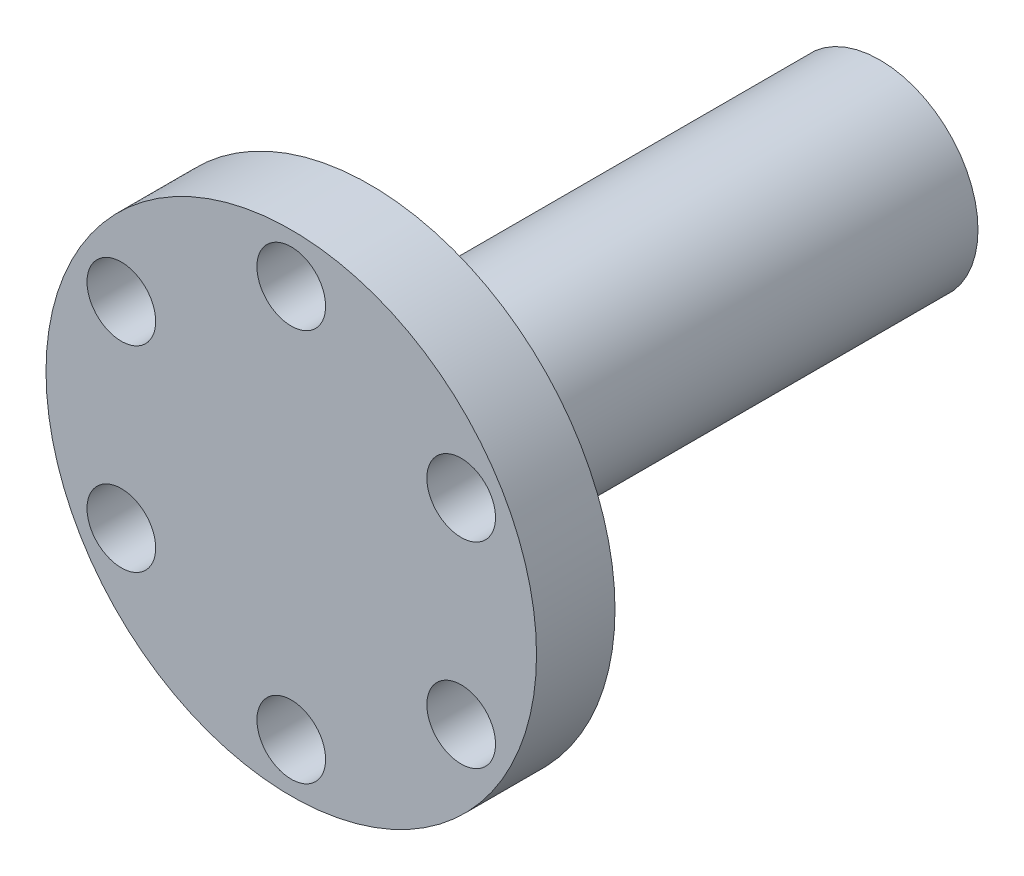
ISO-10303-21;
HEADER;
FILE_DESCRIPTION(('STEP AP214'),'2;1');
FILE_NAME('part.step','',(''),(''),'','','');
FILE_SCHEMA(('AUTOMOTIVE_DESIGN { 1 0 10303 214 1 1 1 1 }'));
ENDSEC;
DATA;
#1=APPLICATION_CONTEXT('core data for automotive mechanical design processes');
#2=APPLICATION_PROTOCOL_DEFINITION('international standard','automotive_design',2000,#1);
#3=PRODUCT_CONTEXT('',#1,'mechanical');
#4=PRODUCT('Part','Part','',(#3));
#5=PRODUCT_RELATED_PRODUCT_CATEGORY('part','',(#4));
#6=PRODUCT_DEFINITION_FORMATION('','',#4);
#7=PRODUCT_DEFINITION_CONTEXT('part definition',#1,'design');
#8=PRODUCT_DEFINITION('design','',#6,#7);
#9=PRODUCT_DEFINITION_SHAPE('','',#8);
#10=(LENGTH_UNIT() NAMED_UNIT(*) SI_UNIT(.MILLI.,.METRE.));
#11=(NAMED_UNIT(*) PLANE_ANGLE_UNIT() SI_UNIT($,.RADIAN.));
#12=(NAMED_UNIT(*) SI_UNIT($,.STERADIAN.) SOLID_ANGLE_UNIT());
#13=UNCERTAINTY_MEASURE_WITH_UNIT(LENGTH_MEASURE(1.E-05),#10,'distance_accuracy_value','');
#14=(GEOMETRIC_REPRESENTATION_CONTEXT(3) GLOBAL_UNCERTAINTY_ASSIGNED_CONTEXT((#13)) GLOBAL_UNIT_ASSIGNED_CONTEXT((#10,
#11,#12)) REPRESENTATION_CONTEXT('',''));
#15=CARTESIAN_POINT('',(0.,0.,0.));
#16=DIRECTION('',(0.,0.,1.));
#17=DIRECTION('',(1.,0.,0.));
#18=AXIS2_PLACEMENT_3D('',#15,#16,#17);
#19=CARTESIAN_POINT('',(5.00000000000001,0.,-4.));
#20=DIRECTION('',(0.,0.,1.));
#21=DIRECTION('',(1.,0.,0.));
#22=AXIS2_PLACEMENT_3D('',#19,#20,#21);
#23=PLANE('',#22);
#24=CARTESIAN_POINT('',(0.,10.,-4.));
#25=DIRECTION('',(0.,0.,-1.));
#26=DIRECTION('',(-1.,0.,0.));
#27=AXIS2_PLACEMENT_3D('',#24,#25,#26);
#28=CIRCLE('',#27,1.75);
#29=CARTESIAN_POINT('',(-1.75,10.,-4.));
#30=VERTEX_POINT('',#29);
#31=EDGE_CURVE('E92',#30,#30,#28,.T.);
#32=ORIENTED_EDGE('',*,*,#31,.F.);
#33=EDGE_LOOP('',(#32));
#34=FACE_BOUND('',#33,.T.);
#35=CARTESIAN_POINT('',(8.66025403784411,4.9999999999995,-4.));
#36=DIRECTION('',(0.,0.,-1.));
#37=DIRECTION('',(-1.,0.,0.));
#38=AXIS2_PLACEMENT_3D('',#35,#36,#37);
#39=CIRCLE('',#38,1.75000000000053);
#40=CARTESIAN_POINT('',(6.91025403784357,4.9999999999995,-4.));
#41=VERTEX_POINT('',#40);
#42=EDGE_CURVE('E93',#41,#41,#39,.T.);
#43=ORIENTED_EDGE('',*,*,#42,.F.);
#44=EDGE_LOOP('',(#43));
#45=FACE_BOUND('',#44,.T.);
#46=CARTESIAN_POINT('',(8.66025403784354,-5.00000000000049,-4.));
#47=DIRECTION('',(0.,0.,-1.));
#48=DIRECTION('',(-1.,0.,0.));
#49=AXIS2_PLACEMENT_3D('',#46,#47,#48);
#50=CIRCLE('',#49,1.75000000000104);
#51=CARTESIAN_POINT('',(6.91025403784249,-5.00000000000049,-4.));
#52=VERTEX_POINT('',#51);
#53=EDGE_CURVE('E59',#52,#52,#50,.T.);
#54=ORIENTED_EDGE('',*,*,#53,.F.);
#55=EDGE_LOOP('',(#54));
#56=FACE_BOUND('',#55,.T.);
#57=CARTESIAN_POINT('',(-1.13319443681872E-12,-10.,-4.));
#58=DIRECTION('',(0.,0.,-1.));
#59=DIRECTION('',(-1.,0.,0.));
#60=AXIS2_PLACEMENT_3D('',#57,#58,#59);
#61=CIRCLE('',#60,1.75000000000115);
#62=CARTESIAN_POINT('',(-1.75000000000228,-10.,-4.));
#63=VERTEX_POINT('',#62);
#64=EDGE_CURVE('E68',#63,#63,#61,.T.);
#65=ORIENTED_EDGE('',*,*,#64,.F.);
#66=EDGE_LOOP('',(#65));
#67=FACE_BOUND('',#66,.T.);
#68=CARTESIAN_POINT('',(-8.66025403784524,-4.99999999999951,-4.));
#69=DIRECTION('',(0.,0.,-1.));
#70=DIRECTION('',(-1.,0.,0.));
#71=AXIS2_PLACEMENT_3D('',#68,#69,#70);
#72=CIRCLE('',#71,1.75000000000072);
#73=CARTESIAN_POINT('',(-10.410254037846,-4.99999999999951,-4.));
#74=VERTEX_POINT('',#73);
#75=EDGE_CURVE('E76',#74,#74,#72,.T.);
#76=ORIENTED_EDGE('',*,*,#75,.F.);
#77=EDGE_LOOP('',(#76));
#78=FACE_BOUND('',#77,.T.);
#79=CARTESIAN_POINT('',(-8.66025403784467,5.00000000000049,-4.));
#80=DIRECTION('',(0.,0.,-1.));
#81=DIRECTION('',(-1.,0.,0.));
#82=AXIS2_PLACEMENT_3D('',#79,#80,#81);
#83=CIRCLE('',#82,1.75000000000015);
#84=CARTESIAN_POINT('',(-10.4102540378448,5.00000000000049,-4.));
#85=VERTEX_POINT('',#84);
#86=EDGE_CURVE('E84',#85,#85,#83,.T.);
#87=ORIENTED_EDGE('',*,*,#86,.F.);
#88=EDGE_LOOP('',(#87));
#89=FACE_BOUND('',#88,.T.);
#90=CARTESIAN_POINT('',(0.,0.,-4.));
#91=DIRECTION('',(0.,0.,1.));
#92=DIRECTION('',(1.,0.,0.));
#93=AXIS2_PLACEMENT_3D('',#90,#91,#92);
#94=CIRCLE('',#93,12.5);
#95=CARTESIAN_POINT('',(12.5,0.,-4.));
#96=VERTEX_POINT('',#95);
#97=EDGE_CURVE('E53',#96,#96,#94,.T.);
#98=ORIENTED_EDGE('',*,*,#97,.F.);
#99=EDGE_LOOP('',(#98));
#100=FACE_BOUND('',#99,.T.);
#101=CARTESIAN_POINT('',(0.,0.,-4.));
#102=DIRECTION('',(0.,0.,1.));
#103=DIRECTION('',(1.,0.,0.));
#104=AXIS2_PLACEMENT_3D('',#101,#102,#103);
#105=CIRCLE('',#104,5.00000000000001);
#106=CARTESIAN_POINT('',(5.00000000000001,0.,-4.));
#107=VERTEX_POINT('',#106);
#108=EDGE_CURVE('E10',#107,#107,#105,.T.);
#109=ORIENTED_EDGE('',*,*,#108,.T.);
#110=EDGE_LOOP('',(#109));
#111=FACE_BOUND('',#110,.T.);
#112=ADVANCED_FACE('F38',(#34,#45,#56,#67,#78,#89,#100,#111),#23,.F.);
#113=CARTESIAN_POINT('',(5.00000000000001,0.,0.));
#114=DIRECTION('',(0.,0.,1.));
#115=DIRECTION('',(1.,0.,0.));
#116=AXIS2_PLACEMENT_3D('',#113,#114,#115);
#117=PLANE('',#116);
#118=CARTESIAN_POINT('',(0.,10.,0.));
#119=DIRECTION('',(0.,0.,-1.));
#120=DIRECTION('',(-1.,0.,0.));
#121=AXIS2_PLACEMENT_3D('',#118,#119,#120);
#122=CIRCLE('',#121,1.75);
#123=CARTESIAN_POINT('',(-1.75,10.,0.));
#124=VERTEX_POINT('',#123);
#125=EDGE_CURVE('E103',#124,#124,#122,.T.);
#126=ORIENTED_EDGE('',*,*,#125,.T.);
#127=EDGE_LOOP('',(#126));
#128=FACE_BOUND('',#127,.T.);
#129=CARTESIAN_POINT('',(8.66025403784411,4.9999999999995,0.));
#130=DIRECTION('',(0.,0.,-1.));
#131=DIRECTION('',(-1.,0.,0.));
#132=AXIS2_PLACEMENT_3D('',#129,#130,#131);
#133=CIRCLE('',#132,1.75000000000053);
#134=CARTESIAN_POINT('',(6.91025403784357,4.9999999999995,0.));
#135=VERTEX_POINT('',#134);
#136=EDGE_CURVE('E64',#135,#135,#133,.T.);
#137=ORIENTED_EDGE('',*,*,#136,.T.);
#138=EDGE_LOOP('',(#137));
#139=FACE_BOUND('',#138,.T.);
#140=CARTESIAN_POINT('',(8.66025403784354,-5.00000000000049,0.));
#141=DIRECTION('',(0.,0.,-1.));
#142=DIRECTION('',(-1.,0.,0.));
#143=AXIS2_PLACEMENT_3D('',#140,#141,#142);
#144=CIRCLE('',#143,1.75000000000104);
#145=CARTESIAN_POINT('',(6.91025403784249,-5.00000000000049,0.));
#146=VERTEX_POINT('',#145);
#147=EDGE_CURVE('E63',#146,#146,#144,.T.);
#148=ORIENTED_EDGE('',*,*,#147,.T.);
#149=EDGE_LOOP('',(#148));
#150=FACE_BOUND('',#149,.T.);
#151=CARTESIAN_POINT('',(-1.13319443681872E-12,-10.,0.));
#152=DIRECTION('',(0.,0.,-1.));
#153=DIRECTION('',(-1.,0.,0.));
#154=AXIS2_PLACEMENT_3D('',#151,#152,#153);
#155=CIRCLE('',#154,1.75000000000115);
#156=CARTESIAN_POINT('',(-1.75000000000228,-10.,0.));
#157=VERTEX_POINT('',#156);
#158=EDGE_CURVE('E72',#157,#157,#155,.T.);
#159=ORIENTED_EDGE('',*,*,#158,.T.);
#160=EDGE_LOOP('',(#159));
#161=FACE_BOUND('',#160,.T.);
#162=CARTESIAN_POINT('',(-8.66025403784524,-4.99999999999951,0.));
#163=DIRECTION('',(0.,0.,-1.));
#164=DIRECTION('',(-1.,0.,0.));
#165=AXIS2_PLACEMENT_3D('',#162,#163,#164);
#166=CIRCLE('',#165,1.75000000000072);
#167=CARTESIAN_POINT('',(-10.410254037846,-4.99999999999951,0.));
#168=VERTEX_POINT('',#167);
#169=EDGE_CURVE('E80',#168,#168,#166,.T.);
#170=ORIENTED_EDGE('',*,*,#169,.T.);
#171=EDGE_LOOP('',(#170));
#172=FACE_BOUND('',#171,.T.);
#173=CARTESIAN_POINT('',(-8.66025403784467,5.00000000000049,0.));
#174=DIRECTION('',(0.,0.,-1.));
#175=DIRECTION('',(-1.,0.,0.));
#176=AXIS2_PLACEMENT_3D('',#173,#174,#175);
#177=CIRCLE('',#176,1.75000000000015);
#178=CARTESIAN_POINT('',(-10.4102540378448,5.00000000000049,0.));
#179=VERTEX_POINT('',#178);
#180=EDGE_CURVE('E88',#179,#179,#177,.T.);
#181=ORIENTED_EDGE('',*,*,#180,.T.);
#182=EDGE_LOOP('',(#181));
#183=FACE_BOUND('',#182,.T.);
#184=CARTESIAN_POINT('',(0.,0.,0.));
#185=DIRECTION('',(0.,0.,1.));
#186=DIRECTION('',(1.,0.,0.));
#187=AXIS2_PLACEMENT_3D('',#184,#185,#186);
#188=CIRCLE('',#187,12.5);
#189=CARTESIAN_POINT('',(12.5,0.,0.));
#190=VERTEX_POINT('',#189);
#191=EDGE_CURVE('E47',#190,#190,#188,.T.);
#192=ORIENTED_EDGE('',*,*,#191,.T.);
#193=EDGE_LOOP('',(#192));
#194=FACE_BOUND('',#193,.T.);
#195=ADVANCED_FACE('F124',(#128,#139,#150,#161,#172,#183,#194),#117,.T.);
#196=CARTESIAN_POINT('',(0.,0.,0.));
#197=DIRECTION('',(0.,0.,1.));
#198=DIRECTION('',(1.,0.,0.));
#199=AXIS2_PLACEMENT_3D('',#196,#197,#198);
#200=CYLINDRICAL_SURFACE('',#199,12.5);
#201=ORIENTED_EDGE('',*,*,#97,.T.);
#202=EDGE_LOOP('',(#201));
#203=FACE_BOUND('',#202,.T.);
#204=ORIENTED_EDGE('',*,*,#191,.F.);
#205=EDGE_LOOP('',(#204));
#206=FACE_BOUND('',#205,.T.);
#207=ADVANCED_FACE('F118',(#203,#206),#200,.T.);
#208=CARTESIAN_POINT('',(0.,0.,-30.));
#209=DIRECTION('',(0.,0.,1.));
#210=DIRECTION('',(1.,0.,0.));
#211=AXIS2_PLACEMENT_3D('',#208,#209,#210);
#212=PLANE('',#211);
#213=CARTESIAN_POINT('',(0.,0.,-30.));
#214=DIRECTION('',(0.,0.,1.));
#215=DIRECTION('',(1.,0.,0.));
#216=AXIS2_PLACEMENT_3D('',#213,#214,#215);
#217=CIRCLE('',#216,5.00000000000001);
#218=CARTESIAN_POINT('',(5.00000000000001,0.,-30.));
#219=VERTEX_POINT('',#218);
#220=EDGE_CURVE('E42',#219,#219,#217,.T.);
#221=ORIENTED_EDGE('',*,*,#220,.F.);
#222=EDGE_LOOP('',(#221));
#223=FACE_BOUND('',#222,.T.);
#224=ADVANCED_FACE('F40',(#223),#212,.F.);
#225=CARTESIAN_POINT('',(0.,0.,0.));
#226=DIRECTION('',(0.,0.,1.));
#227=DIRECTION('',(1.,0.,0.));
#228=AXIS2_PLACEMENT_3D('',#225,#226,#227);
#229=CYLINDRICAL_SURFACE('',#228,5.00000000000001);
#230=ORIENTED_EDGE('',*,*,#220,.T.);
#231=EDGE_LOOP('',(#230));
#232=FACE_BOUND('',#231,.T.);
#233=ORIENTED_EDGE('',*,*,#108,.F.);
#234=EDGE_LOOP('',(#233));
#235=FACE_BOUND('',#234,.T.);
#236=ADVANCED_FACE('F114',(#232,#235),#229,.T.);
#237=CARTESIAN_POINT('',(-8.66025403784467,5.00000000000049,0.));
#238=DIRECTION('',(0.,0.,-1.));
#239=DIRECTION('',(-1.,0.,0.));
#240=AXIS2_PLACEMENT_3D('',#237,#238,#239);
#241=CYLINDRICAL_SURFACE('',#240,1.75000000000015);
#242=ORIENTED_EDGE('',*,*,#180,.F.);
#243=EDGE_LOOP('',(#242));
#244=FACE_BOUND('',#243,.T.);
#245=ORIENTED_EDGE('',*,*,#86,.T.);
#246=EDGE_LOOP('',(#245));
#247=FACE_BOUND('',#246,.T.);
#248=ADVANCED_FACE('F123',(#244,#247),#241,.F.);
#249=CARTESIAN_POINT('',(-8.66025403784524,-4.99999999999951,0.));
#250=DIRECTION('',(0.,0.,-1.));
#251=DIRECTION('',(-1.,0.,0.));
#252=AXIS2_PLACEMENT_3D('',#249,#250,#251);
#253=CYLINDRICAL_SURFACE('',#252,1.75000000000072);
#254=ORIENTED_EDGE('',*,*,#169,.F.);
#255=EDGE_LOOP('',(#254));
#256=FACE_BOUND('',#255,.T.);
#257=ORIENTED_EDGE('',*,*,#75,.T.);
#258=EDGE_LOOP('',(#257));
#259=FACE_BOUND('',#258,.T.);
#260=ADVANCED_FACE('F145',(#256,#259),#253,.F.);
#261=CARTESIAN_POINT('',(-1.13319443681872E-12,-10.,0.));
#262=DIRECTION('',(0.,0.,-1.));
#263=DIRECTION('',(-1.,0.,0.));
#264=AXIS2_PLACEMENT_3D('',#261,#262,#263);
#265=CYLINDRICAL_SURFACE('',#264,1.75000000000115);
#266=ORIENTED_EDGE('',*,*,#158,.F.);
#267=EDGE_LOOP('',(#266));
#268=FACE_BOUND('',#267,.T.);
#269=ORIENTED_EDGE('',*,*,#64,.T.);
#270=EDGE_LOOP('',(#269));
#271=FACE_BOUND('',#270,.T.);
#272=ADVANCED_FACE('F141',(#268,#271),#265,.F.);
#273=CARTESIAN_POINT('',(8.66025403784354,-5.00000000000049,0.));
#274=DIRECTION('',(0.,0.,-1.));
#275=DIRECTION('',(-1.,0.,0.));
#276=AXIS2_PLACEMENT_3D('',#273,#274,#275);
#277=CYLINDRICAL_SURFACE('',#276,1.75000000000104);
#278=ORIENTED_EDGE('',*,*,#147,.F.);
#279=EDGE_LOOP('',(#278));
#280=FACE_BOUND('',#279,.T.);
#281=ORIENTED_EDGE('',*,*,#53,.T.);
#282=EDGE_LOOP('',(#281));
#283=FACE_BOUND('',#282,.T.);
#284=ADVANCED_FACE('F137',(#280,#283),#277,.F.);
#285=CARTESIAN_POINT('',(8.66025403784411,4.9999999999995,0.));
#286=DIRECTION('',(0.,0.,-1.));
#287=DIRECTION('',(-1.,0.,0.));
#288=AXIS2_PLACEMENT_3D('',#285,#286,#287);
#289=CYLINDRICAL_SURFACE('',#288,1.75000000000053);
#290=ORIENTED_EDGE('',*,*,#136,.F.);
#291=EDGE_LOOP('',(#290));
#292=FACE_BOUND('',#291,.T.);
#293=ORIENTED_EDGE('',*,*,#42,.T.);
#294=EDGE_LOOP('',(#293));
#295=FACE_BOUND('',#294,.T.);
#296=ADVANCED_FACE('F140',(#292,#295),#289,.F.);
#297=CARTESIAN_POINT('',(0.,10.,0.));
#298=DIRECTION('',(0.,0.,-1.));
#299=DIRECTION('',(-1.,0.,0.));
#300=AXIS2_PLACEMENT_3D('',#297,#298,#299);
#301=CYLINDRICAL_SURFACE('',#300,1.75);
#302=ORIENTED_EDGE('',*,*,#125,.F.);
#303=EDGE_LOOP('',(#302));
#304=FACE_BOUND('',#303,.T.);
#305=ORIENTED_EDGE('',*,*,#31,.T.);
#306=EDGE_LOOP('',(#305));
#307=FACE_BOUND('',#306,.T.);
#308=ADVANCED_FACE('F155',(#304,#307),#301,.F.);
#309=CLOSED_SHELL('',(#112,#195,#207,#224,#236,#248,#260,#272,#284,#296,#308));
#310=MANIFOLD_SOLID_BREP('B2',#309);
#311=ADVANCED_BREP_SHAPE_REPRESENTATION('',(#18,#310),#14);
#312=SHAPE_DEFINITION_REPRESENTATION(#9,#311);
ENDSEC;
END-ISO-10303-21;
